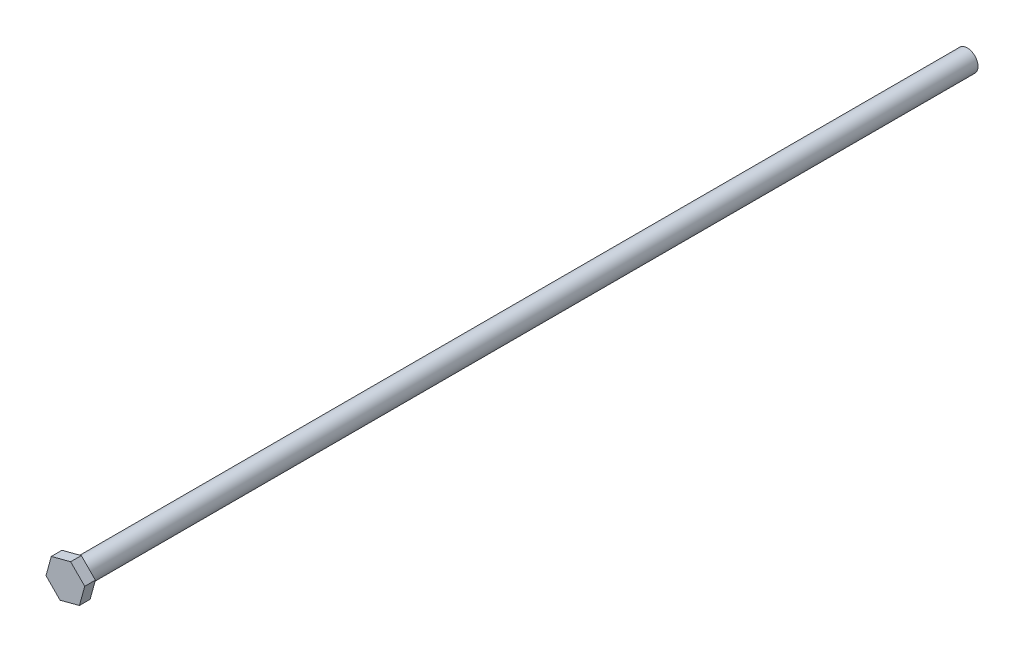
ISO-10303-21;
HEADER;
FILE_DESCRIPTION(('STEP AP214'),'2;1');
FILE_NAME('part.step','',(''),(''),'','','');
FILE_SCHEMA(('AUTOMOTIVE_DESIGN { 1 0 10303 214 1 1 1 1 }'));
ENDSEC;
DATA;
#1=APPLICATION_CONTEXT('core data for automotive mechanical design processes');
#2=APPLICATION_PROTOCOL_DEFINITION('international standard','automotive_design',2000,#1);
#3=PRODUCT_CONTEXT('',#1,'mechanical');
#4=PRODUCT('Part','Part','',(#3));
#5=PRODUCT_RELATED_PRODUCT_CATEGORY('part','',(#4));
#6=PRODUCT_DEFINITION_FORMATION('','',#4);
#7=PRODUCT_DEFINITION_CONTEXT('part definition',#1,'design');
#8=PRODUCT_DEFINITION('design','',#6,#7);
#9=PRODUCT_DEFINITION_SHAPE('','',#8);
#10=(LENGTH_UNIT() NAMED_UNIT(*) SI_UNIT(.MILLI.,.METRE.));
#11=(NAMED_UNIT(*) PLANE_ANGLE_UNIT() SI_UNIT($,.RADIAN.));
#12=(NAMED_UNIT(*) SI_UNIT($,.STERADIAN.) SOLID_ANGLE_UNIT());
#13=UNCERTAINTY_MEASURE_WITH_UNIT(LENGTH_MEASURE(1.E-05),#10,'distance_accuracy_value','');
#14=(GEOMETRIC_REPRESENTATION_CONTEXT(3) GLOBAL_UNCERTAINTY_ASSIGNED_CONTEXT((#13)) GLOBAL_UNIT_ASSIGNED_CONTEXT((#10,
#11,#12)) REPRESENTATION_CONTEXT('',''));
#15=CARTESIAN_POINT('',(0.,0.,0.));
#16=DIRECTION('',(0.,0.,1.));
#17=DIRECTION('',(1.,0.,0.));
#18=AXIS2_PLACEMENT_3D('',#15,#16,#17);
#19=CARTESIAN_POINT('',(0.,0.,167.));
#20=DIRECTION('',(0.,0.,-1.));
#21=DIRECTION('',(-1.,0.,0.));
#22=AXIS2_PLACEMENT_3D('',#19,#20,#21);
#23=CYLINDRICAL_SURFACE('',#22,2.);
#24=CARTESIAN_POINT('',(0.,0.,167.));
#25=DIRECTION('',(0.,0.,1.));
#26=DIRECTION('',(1.,0.,0.));
#27=AXIS2_PLACEMENT_3D('',#24,#25,#26);
#28=CIRCLE('',#27,2.);
#29=CARTESIAN_POINT('',(2.,0.,167.));
#30=VERTEX_POINT('',#29);
#31=EDGE_CURVE('E11',#30,#30,#28,.T.);
#32=ORIENTED_EDGE('',*,*,#31,.F.);
#33=EDGE_LOOP('',(#32));
#34=FACE_BOUND('',#33,.T.);
#35=CARTESIAN_POINT('',(0.,0.,0.));
#36=DIRECTION('',(0.,0.,1.));
#37=DIRECTION('',(1.,0.,0.));
#38=AXIS2_PLACEMENT_3D('',#35,#36,#37);
#39=CIRCLE('',#38,2.);
#40=CARTESIAN_POINT('',(2.,0.,0.));
#41=VERTEX_POINT('',#40);
#42=EDGE_CURVE('E41',#41,#41,#39,.T.);
#43=ORIENTED_EDGE('',*,*,#42,.T.);
#44=EDGE_LOOP('',(#43));
#45=FACE_BOUND('',#44,.T.);
#46=ADVANCED_FACE('F38',(#34,#45),#23,.T.);
#47=CARTESIAN_POINT('',(0.,0.,0.));
#48=DIRECTION('',(0.,0.,1.));
#49=DIRECTION('',(1.,0.,0.));
#50=AXIS2_PLACEMENT_3D('',#47,#48,#49);
#51=PLANE('',#50);
#52=ORIENTED_EDGE('',*,*,#42,.F.);
#53=EDGE_LOOP('',(#52));
#54=FACE_BOUND('',#53,.T.);
#55=ADVANCED_FACE('F146',(#54),#51,.F.);
#56=CARTESIAN_POINT('',(-3.62792561382376,-0.949028840742746,169.));
#57=DIRECTION('',(0.964370710662133,-0.264554592507884,0.));
#58=DIRECTION('',(0.264554592507884,0.964370710662133,0.));
#59=AXIS2_PLACEMENT_3D('',#56,#57,#58);
#60=PLANE('',#59);
#61=DIRECTION('',(-0.264554592507884,-0.964370710662133,0.));
#62=VECTOR('',#61,1.);
#63=CARTESIAN_POINT('',(-3.62792561382376,-0.949028840742746,167.));
#64=LINE('',#63,#62);
#65=CARTESIAN_POINT('',(-2.63584589191919,2.66736132424025,167.));
#66=VERTEX_POINT('',#65);
#67=CARTESIAN_POINT('',(-3.62792561382376,-0.949028840742746,167.));
#68=VERTEX_POINT('',#67);
#69=EDGE_CURVE('E123',#66,#68,#64,.T.);
#70=ORIENTED_EDGE('',*,*,#69,.T.);
#71=DIRECTION('',(0.,0.,-1.));
#72=VECTOR('',#71,1.);
#73=CARTESIAN_POINT('',(-3.62792561382376,-0.949028840742746,169.));
#74=LINE('',#73,#72);
#75=CARTESIAN_POINT('',(-3.62792561382376,-0.949028840742746,169.));
#76=VERTEX_POINT('',#75);
#77=EDGE_CURVE('E140',#76,#68,#74,.T.);
#78=ORIENTED_EDGE('',*,*,#77,.F.);
#79=DIRECTION('',(-0.264554592507884,-0.964370710662133,0.));
#80=VECTOR('',#79,1.);
#81=CARTESIAN_POINT('',(-3.62792561382376,-0.949028840742746,169.));
#82=LINE('',#81,#80);
#83=CARTESIAN_POINT('',(-2.63584589191919,2.66736132424025,169.));
#84=VERTEX_POINT('',#83);
#85=EDGE_CURVE('E133',#84,#76,#82,.T.);
#86=ORIENTED_EDGE('',*,*,#85,.F.);
#87=DIRECTION('',(0.,0.,-1.));
#88=VECTOR('',#87,1.);
#89=CARTESIAN_POINT('',(-2.63584589191919,2.66736132424025,169.));
#90=LINE('',#89,#88);
#91=EDGE_CURVE('E119',#84,#66,#90,.T.);
#92=ORIENTED_EDGE('',*,*,#91,.T.);
#93=EDGE_LOOP('',(#70,#78,#86,#92));
#94=FACE_BOUND('',#93,.T.);
#95=ADVANCED_FACE('F148',(#94),#60,.F.);
#96=CARTESIAN_POINT('',(-0.992079721904565,-3.616390164983,169.));
#97=DIRECTION('',(0.711296353130734,0.702892237845118,0.));
#98=DIRECTION('',(-0.702892237845118,0.711296353130734,0.));
#99=AXIS2_PLACEMENT_3D('',#96,#97,#98);
#100=PLANE('',#99);
#101=DIRECTION('',(0.702892237845118,-0.711296353130734,0.));
#102=VECTOR('',#101,1.);
#103=CARTESIAN_POINT('',(-0.992079721904565,-3.616390164983,167.));
#104=LINE('',#103,#102);
#105=CARTESIAN_POINT('',(-0.992079721904565,-3.616390164983,167.));
#106=VERTEX_POINT('',#105);
#107=EDGE_CURVE('E126',#68,#106,#104,.T.);
#108=ORIENTED_EDGE('',*,*,#107,.T.);
#109=DIRECTION('',(0.,0.,-1.));
#110=VECTOR('',#109,1.);
#111=CARTESIAN_POINT('',(-0.992079721904565,-3.616390164983,169.));
#112=LINE('',#111,#110);
#113=CARTESIAN_POINT('',(-0.992079721904565,-3.616390164983,169.));
#114=VERTEX_POINT('',#113);
#115=EDGE_CURVE('E137',#114,#106,#112,.T.);
#116=ORIENTED_EDGE('',*,*,#115,.F.);
#117=DIRECTION('',(0.702892237845118,-0.711296353130734,0.));
#118=VECTOR('',#117,1.);
#119=CARTESIAN_POINT('',(-0.992079721904565,-3.616390164983,169.));
#120=LINE('',#119,#118);
#121=EDGE_CURVE('E92',#76,#114,#120,.T.);
#122=ORIENTED_EDGE('',*,*,#121,.F.);
#123=ORIENTED_EDGE('',*,*,#77,.T.);
#124=EDGE_LOOP('',(#108,#116,#122,#123));
#125=FACE_BOUND('',#124,.T.);
#126=ADVANCED_FACE('F153',(#125),#100,.F.);
#127=CARTESIAN_POINT('',(2.63584589191919,-2.66736132424025,169.));
#128=DIRECTION('',(-0.253074357531399,0.967446830353002,0.));
#129=DIRECTION('',(-0.967446830353002,-0.253074357531399,0.));
#130=AXIS2_PLACEMENT_3D('',#127,#128,#129);
#131=PLANE('',#130);
#132=DIRECTION('',(0.967446830353002,0.253074357531399,0.));
#133=VECTOR('',#132,1.);
#134=CARTESIAN_POINT('',(2.63584589191919,-2.66736132424025,167.));
#135=LINE('',#134,#133);
#136=CARTESIAN_POINT('',(2.63584589191919,-2.66736132424025,167.));
#137=VERTEX_POINT('',#136);
#138=EDGE_CURVE('E128',#106,#137,#135,.T.);
#139=ORIENTED_EDGE('',*,*,#138,.T.);
#140=DIRECTION('',(0.,0.,-1.));
#141=VECTOR('',#140,1.);
#142=CARTESIAN_POINT('',(2.63584589191919,-2.66736132424025,169.));
#143=LINE('',#142,#141);
#144=CARTESIAN_POINT('',(2.63584589191919,-2.66736132424025,169.));
#145=VERTEX_POINT('',#144);
#146=EDGE_CURVE('E114',#145,#137,#143,.T.);
#147=ORIENTED_EDGE('',*,*,#146,.F.);
#148=DIRECTION('',(0.967446830353002,0.253074357531399,0.));
#149=VECTOR('',#148,1.);
#150=CARTESIAN_POINT('',(2.63584589191919,-2.66736132424025,169.));
#151=LINE('',#150,#149);
#152=EDGE_CURVE('E105',#114,#145,#151,.T.);
#153=ORIENTED_EDGE('',*,*,#152,.F.);
#154=ORIENTED_EDGE('',*,*,#115,.T.);
#155=EDGE_LOOP('',(#139,#147,#153,#154));
#156=FACE_BOUND('',#155,.T.);
#157=ADVANCED_FACE('F160',(#156),#131,.F.);
#158=CARTESIAN_POINT('',(3.62792561382376,0.949028840742745,169.));
#159=DIRECTION('',(-0.964370710662133,0.264554592507884,0.));
#160=DIRECTION('',(-0.264554592507884,-0.964370710662133,0.));
#161=AXIS2_PLACEMENT_3D('',#158,#159,#160);
#162=PLANE('',#161);
#163=DIRECTION('',(0.264554592507884,0.964370710662133,0.));
#164=VECTOR('',#163,1.);
#165=CARTESIAN_POINT('',(3.62792561382376,0.949028840742745,167.));
#166=LINE('',#165,#164);
#167=CARTESIAN_POINT('',(3.62792561382376,0.949028840742745,167.));
#168=VERTEX_POINT('',#167);
#169=EDGE_CURVE('E113',#137,#168,#166,.T.);
#170=ORIENTED_EDGE('',*,*,#169,.T.);
#171=DIRECTION('',(0.,0.,-1.));
#172=VECTOR('',#171,1.);
#173=CARTESIAN_POINT('',(3.62792561382376,0.949028840742745,169.));
#174=LINE('',#173,#172);
#175=CARTESIAN_POINT('',(3.62792561382376,0.949028840742745,169.));
#176=VERTEX_POINT('',#175);
#177=EDGE_CURVE('E110',#176,#168,#174,.T.);
#178=ORIENTED_EDGE('',*,*,#177,.F.);
#179=DIRECTION('',(0.264554592507884,0.964370710662133,0.));
#180=VECTOR('',#179,1.);
#181=CARTESIAN_POINT('',(3.62792561382376,0.949028840742745,169.));
#182=LINE('',#181,#180);
#183=EDGE_CURVE('E99',#145,#176,#182,.T.);
#184=ORIENTED_EDGE('',*,*,#183,.F.);
#185=ORIENTED_EDGE('',*,*,#146,.T.);
#186=EDGE_LOOP('',(#170,#178,#184,#185));
#187=FACE_BOUND('',#186,.T.);
#188=ADVANCED_FACE('F111',(#187),#162,.F.);
#189=CARTESIAN_POINT('',(0.992079721904566,3.616390164983,169.));
#190=DIRECTION('',(-0.711296353130734,-0.702892237845118,0.));
#191=DIRECTION('',(0.702892237845118,-0.711296353130734,0.));
#192=AXIS2_PLACEMENT_3D('',#189,#190,#191);
#193=PLANE('',#192);
#194=DIRECTION('',(-0.702892237845118,0.711296353130734,0.));
#195=VECTOR('',#194,1.);
#196=CARTESIAN_POINT('',(0.992079721904566,3.616390164983,167.));
#197=LINE('',#196,#195);
#198=CARTESIAN_POINT('',(0.992079721904566,3.616390164983,167.));
#199=VERTEX_POINT('',#198);
#200=EDGE_CURVE('E77',#168,#199,#197,.T.);
#201=ORIENTED_EDGE('',*,*,#200,.T.);
#202=DIRECTION('',(0.,0.,-1.));
#203=VECTOR('',#202,1.);
#204=CARTESIAN_POINT('',(0.992079721904566,3.616390164983,169.));
#205=LINE('',#204,#203);
#206=CARTESIAN_POINT('',(0.992079721904566,3.616390164983,169.));
#207=VERTEX_POINT('',#206);
#208=EDGE_CURVE('E115',#207,#199,#205,.T.);
#209=ORIENTED_EDGE('',*,*,#208,.F.);
#210=DIRECTION('',(-0.702892237845118,0.711296353130734,0.));
#211=VECTOR('',#210,1.);
#212=CARTESIAN_POINT('',(0.992079721904566,3.616390164983,169.));
#213=LINE('',#212,#211);
#214=EDGE_CURVE('E103',#176,#207,#213,.T.);
#215=ORIENTED_EDGE('',*,*,#214,.F.);
#216=ORIENTED_EDGE('',*,*,#177,.T.);
#217=EDGE_LOOP('',(#201,#209,#215,#216));
#218=FACE_BOUND('',#217,.T.);
#219=ADVANCED_FACE('F117',(#218),#193,.F.);
#220=CARTESIAN_POINT('',(-2.63584589191919,2.66736132424025,169.));
#221=DIRECTION('',(0.253074357531398,-0.967446830353002,0.));
#222=DIRECTION('',(0.967446830353002,0.253074357531398,0.));
#223=AXIS2_PLACEMENT_3D('',#220,#221,#222);
#224=PLANE('',#223);
#225=DIRECTION('',(-0.967446830353002,-0.253074357531398,0.));
#226=VECTOR('',#225,1.);
#227=CARTESIAN_POINT('',(-2.63584589191919,2.66736132424025,167.));
#228=LINE('',#227,#226);
#229=EDGE_CURVE('E83',#199,#66,#228,.T.);
#230=ORIENTED_EDGE('',*,*,#229,.T.);
#231=ORIENTED_EDGE('',*,*,#91,.F.);
#232=DIRECTION('',(-0.967446830353002,-0.253074357531398,0.));
#233=VECTOR('',#232,1.);
#234=CARTESIAN_POINT('',(-2.63584589191919,2.66736132424025,169.));
#235=LINE('',#234,#233);
#236=EDGE_CURVE('E54',#207,#84,#235,.T.);
#237=ORIENTED_EDGE('',*,*,#236,.F.);
#238=ORIENTED_EDGE('',*,*,#208,.T.);
#239=EDGE_LOOP('',(#230,#231,#237,#238));
#240=FACE_BOUND('',#239,.T.);
#241=ADVANCED_FACE('F168',(#240),#224,.F.);
#242=CARTESIAN_POINT('',(0.,0.,169.));
#243=DIRECTION('',(0.,0.,-1.));
#244=DIRECTION('',(-1.,0.,0.));
#245=AXIS2_PLACEMENT_3D('',#242,#243,#244);
#246=PLANE('',#245);
#247=ORIENTED_EDGE('',*,*,#85,.T.);
#248=ORIENTED_EDGE('',*,*,#121,.T.);
#249=ORIENTED_EDGE('',*,*,#152,.T.);
#250=ORIENTED_EDGE('',*,*,#183,.T.);
#251=ORIENTED_EDGE('',*,*,#214,.T.);
#252=ORIENTED_EDGE('',*,*,#236,.T.);
#253=EDGE_LOOP('',(#247,#248,#249,#250,#251,#252));
#254=FACE_BOUND('',#253,.T.);
#255=ADVANCED_FACE('F101',(#254),#246,.F.);
#256=CARTESIAN_POINT('',(0.,0.,167.));
#257=DIRECTION('',(0.,0.,-1.));
#258=DIRECTION('',(-1.,0.,0.));
#259=AXIS2_PLACEMENT_3D('',#256,#257,#258);
#260=PLANE('',#259);
#261=ORIENTED_EDGE('',*,*,#31,.T.);
#262=EDGE_LOOP('',(#261));
#263=FACE_BOUND('',#262,.T.);
#264=ORIENTED_EDGE('',*,*,#69,.F.);
#265=ORIENTED_EDGE('',*,*,#229,.F.);
#266=ORIENTED_EDGE('',*,*,#200,.F.);
#267=ORIENTED_EDGE('',*,*,#169,.F.);
#268=ORIENTED_EDGE('',*,*,#138,.F.);
#269=ORIENTED_EDGE('',*,*,#107,.F.);
#270=EDGE_LOOP('',(#264,#265,#266,#267,#268,#269));
#271=FACE_BOUND('',#270,.T.);
#272=ADVANCED_FACE('F171',(#263,#271),#260,.T.);
#273=CLOSED_SHELL('',(#46,#55,#95,#126,#157,#188,#219,#241,#255,#272));
#274=MANIFOLD_SOLID_BREP('B2',#273);
#275=ADVANCED_BREP_SHAPE_REPRESENTATION('',(#18,#274),#14);
#276=SHAPE_DEFINITION_REPRESENTATION(#9,#275);
ENDSEC;
END-ISO-10303-21;
